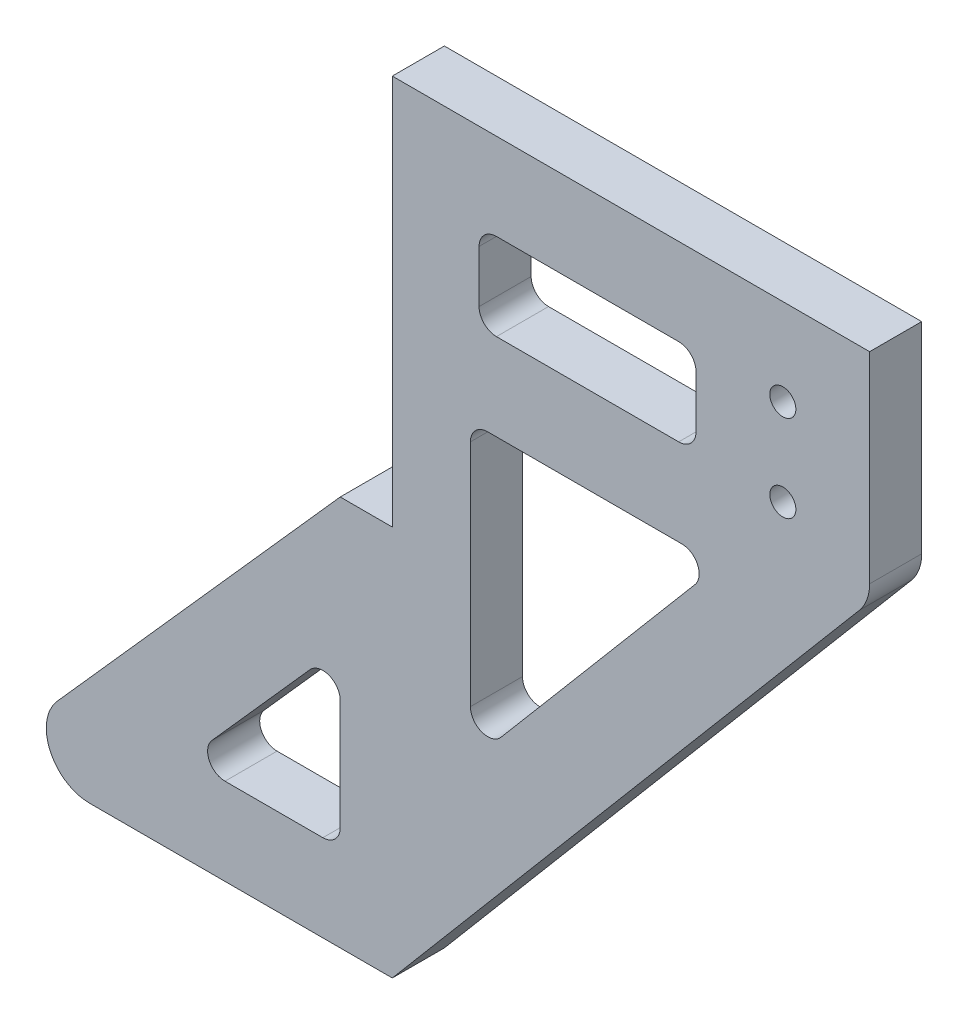
ISO-10303-21;
HEADER;
FILE_DESCRIPTION(('STEP AP214'),'2;1');
FILE_NAME('part.step','',(''),(''),'','','');
FILE_SCHEMA(('AUTOMOTIVE_DESIGN { 1 0 10303 214 1 1 1 1 }'));
ENDSEC;
DATA;
#1=APPLICATION_CONTEXT('core data for automotive mechanical design processes');
#2=APPLICATION_PROTOCOL_DEFINITION('international standard','automotive_design',2000,#1);
#3=PRODUCT_CONTEXT('',#1,'mechanical');
#4=PRODUCT('Part','Part','',(#3));
#5=PRODUCT_RELATED_PRODUCT_CATEGORY('part','',(#4));
#6=PRODUCT_DEFINITION_FORMATION('','',#4);
#7=PRODUCT_DEFINITION_CONTEXT('part definition',#1,'design');
#8=PRODUCT_DEFINITION('design','',#6,#7);
#9=PRODUCT_DEFINITION_SHAPE('','',#8);
#10=(LENGTH_UNIT() NAMED_UNIT(*) SI_UNIT(.MILLI.,.METRE.));
#11=(NAMED_UNIT(*) PLANE_ANGLE_UNIT() SI_UNIT($,.RADIAN.));
#12=(NAMED_UNIT(*) SI_UNIT($,.STERADIAN.) SOLID_ANGLE_UNIT());
#13=UNCERTAINTY_MEASURE_WITH_UNIT(LENGTH_MEASURE(1.E-05),#10,'distance_accuracy_value','');
#14=(GEOMETRIC_REPRESENTATION_CONTEXT(3) GLOBAL_UNCERTAINTY_ASSIGNED_CONTEXT((#13)) GLOBAL_UNIT_ASSIGNED_CONTEXT((#10,
#11,#12)) REPRESENTATION_CONTEXT('',''));
#15=CARTESIAN_POINT('',(0.,0.,0.));
#16=DIRECTION('',(0.,0.,1.));
#17=DIRECTION('',(1.,0.,0.));
#18=AXIS2_PLACEMENT_3D('',#15,#16,#17);
#19=CARTESIAN_POINT('',(0.,0.,6.));
#20=DIRECTION('',(1.,0.,0.));
#21=DIRECTION('',(0.,1.,0.));
#22=AXIS2_PLACEMENT_3D('',#19,#20,#21);
#23=PLANE('',#22);
#24=DIRECTION('',(0.,-1.,0.));
#25=VECTOR('',#24,1.);
#26=CARTESIAN_POINT('',(0.,0.,0.));
#27=LINE('',#26,#25);
#28=CARTESIAN_POINT('',(0.,0.,0.));
#29=VERTEX_POINT('',#28);
#30=CARTESIAN_POINT('',(0.,-45.,0.));
#31=VERTEX_POINT('',#30);
#32=EDGE_CURVE('E255',#29,#31,#27,.T.);
#33=ORIENTED_EDGE('',*,*,#32,.T.);
#34=DIRECTION('',(0.,0.,-1.));
#35=VECTOR('',#34,1.);
#36=CARTESIAN_POINT('',(0.,-45.,6.));
#37=LINE('',#36,#35);
#38=CARTESIAN_POINT('',(0.,-45.,6.));
#39=VERTEX_POINT('',#38);
#40=EDGE_CURVE('E235',#39,#31,#37,.T.);
#41=ORIENTED_EDGE('',*,*,#40,.F.);
#42=DIRECTION('',(0.,-1.,0.));
#43=VECTOR('',#42,1.);
#44=CARTESIAN_POINT('',(0.,0.,6.));
#45=LINE('',#44,#43);
#46=CARTESIAN_POINT('',(0.,0.,6.));
#47=VERTEX_POINT('',#46);
#48=EDGE_CURVE('E241',#47,#39,#45,.T.);
#49=ORIENTED_EDGE('',*,*,#48,.F.);
#50=DIRECTION('',(0.,0.,-1.));
#51=VECTOR('',#50,1.);
#52=CARTESIAN_POINT('',(0.,0.,6.));
#53=LINE('',#52,#51);
#54=EDGE_CURVE('E443',#47,#29,#53,.T.);
#55=ORIENTED_EDGE('',*,*,#54,.T.);
#56=EDGE_LOOP('',(#33,#41,#49,#55));
#57=FACE_BOUND('',#56,.T.);
#58=ADVANCED_FACE('F39',(#57),#23,.F.);
#59=CARTESIAN_POINT('',(0.,-45.,6.));
#60=DIRECTION('',(0.,-1.,0.));
#61=DIRECTION('',(0.,0.,-1.));
#62=AXIS2_PLACEMENT_3D('',#59,#60,#61);
#63=PLANE('',#62);
#64=DIRECTION('',(-1.,0.,0.));
#65=VECTOR('',#64,1.);
#66=CARTESIAN_POINT('',(0.,-45.,0.));
#67=LINE('',#66,#65);
#68=CARTESIAN_POINT('',(-6.,-45.,0.));
#69=VERTEX_POINT('',#68);
#70=EDGE_CURVE('E435',#31,#69,#67,.T.);
#71=ORIENTED_EDGE('',*,*,#70,.T.);
#72=DIRECTION('',(0.,0.,-1.));
#73=VECTOR('',#72,1.);
#74=CARTESIAN_POINT('',(-6.,-45.,6.));
#75=LINE('',#74,#73);
#76=CARTESIAN_POINT('',(-6.,-45.,6.));
#77=VERTEX_POINT('',#76);
#78=EDGE_CURVE('E238',#77,#69,#75,.T.);
#79=ORIENTED_EDGE('',*,*,#78,.F.);
#80=DIRECTION('',(-1.,0.,0.));
#81=VECTOR('',#80,1.);
#82=CARTESIAN_POINT('',(0.,-45.,6.));
#83=LINE('',#82,#81);
#84=EDGE_CURVE('E231',#39,#77,#83,.T.);
#85=ORIENTED_EDGE('',*,*,#84,.F.);
#86=ORIENTED_EDGE('',*,*,#40,.T.);
#87=EDGE_LOOP('',(#71,#79,#85,#86));
#88=FACE_BOUND('',#87,.T.);
#89=ADVANCED_FACE('F233',(#88),#63,.F.);
#90=CARTESIAN_POINT('',(-6.,-45.,6.));
#91=DIRECTION('',(0.74740931868366,-0.66436383882992,0.));
#92=DIRECTION('',(0.66436383882992,0.74740931868366,0.));
#93=AXIS2_PLACEMENT_3D('',#90,#91,#92);
#94=PLANE('',#93);
#95=DIRECTION('',(-0.66436383882992,-0.74740931868366,0.));
#96=VECTOR('',#95,1.);
#97=CARTESIAN_POINT('',(-6.,-45.,0.));
#98=LINE('',#97,#96);
#99=CARTESIAN_POINT('',(-38.6028273829781,-81.6781808058504,0.));
#100=VERTEX_POINT('',#99);
#101=EDGE_CURVE('E429',#69,#100,#98,.T.);
#102=ORIENTED_EDGE('',*,*,#101,.T.);
#103=DIRECTION('',(0.,0.,-1.));
#104=VECTOR('',#103,1.);
#105=CARTESIAN_POINT('',(-38.6028273829781,-81.6781808058504,6.));
#106=LINE('',#105,#104);
#107=CARTESIAN_POINT('',(-38.6028273829781,-81.6781808058504,6.));
#108=VERTEX_POINT('',#107);
#109=EDGE_CURVE('E11',#100,#108,#106,.F.);
#110=ORIENTED_EDGE('',*,*,#109,.T.);
#111=DIRECTION('',(-0.66436383882992,-0.74740931868366,0.));
#112=VECTOR('',#111,1.);
#113=CARTESIAN_POINT('',(-6.,-45.,6.));
#114=LINE('',#113,#112);
#115=EDGE_CURVE('E240',#77,#108,#114,.T.);
#116=ORIENTED_EDGE('',*,*,#115,.F.);
#117=ORIENTED_EDGE('',*,*,#78,.T.);
#118=EDGE_LOOP('',(#102,#110,#116,#117));
#119=FACE_BOUND('',#118,.T.);
#120=ADVANCED_FACE('F470',(#119),#94,.F.);
#121=CARTESIAN_POINT('',(-46.,-90.,6.));
#122=DIRECTION('',(0.,1.,0.));
#123=DIRECTION('',(0.,0.,1.));
#124=AXIS2_PLACEMENT_3D('',#121,#122,#123);
#125=PLANE('',#124);
#126=DIRECTION('',(1.,0.,0.));
#127=VECTOR('',#126,1.);
#128=CARTESIAN_POINT('',(-46.,-90.,6.));
#129=LINE('',#128,#127);
#130=CARTESIAN_POINT('',(-34.8657807895598,-90.,6.));
#131=VERTEX_POINT('',#130);
#132=CARTESIAN_POINT('',(0.,-90.,6.));
#133=VERTEX_POINT('',#132);
#134=EDGE_CURVE('E419',#131,#133,#129,.T.);
#135=ORIENTED_EDGE('',*,*,#134,.F.);
#136=DIRECTION('',(0.,0.,-1.));
#137=VECTOR('',#136,1.);
#138=CARTESIAN_POINT('',(-34.8657807895598,-90.,6.));
#139=LINE('',#138,#137);
#140=CARTESIAN_POINT('',(-34.8657807895598,-90.,0.));
#141=VERTEX_POINT('',#140);
#142=EDGE_CURVE('E48',#131,#141,#139,.T.);
#143=ORIENTED_EDGE('',*,*,#142,.T.);
#144=DIRECTION('',(1.,0.,0.));
#145=VECTOR('',#144,1.);
#146=CARTESIAN_POINT('',(-46.,-90.,0.));
#147=LINE('',#146,#145);
#148=CARTESIAN_POINT('',(0.,-90.,0.));
#149=VERTEX_POINT('',#148);
#150=EDGE_CURVE('E417',#141,#149,#147,.T.);
#151=ORIENTED_EDGE('',*,*,#150,.T.);
#152=DIRECTION('',(0.,0.,-1.));
#153=VECTOR('',#152,1.);
#154=CARTESIAN_POINT('',(0.,-90.,6.));
#155=LINE('',#154,#153);
#156=EDGE_CURVE('E263',#133,#149,#155,.T.);
#157=ORIENTED_EDGE('',*,*,#156,.F.);
#158=EDGE_LOOP('',(#135,#143,#151,#157));
#159=FACE_BOUND('',#158,.T.);
#160=ADVANCED_FACE('F415',(#159),#125,.F.);
#161=CARTESIAN_POINT('',(0.,-90.,6.));
#162=DIRECTION('',(-0.763386285369115,0.645942241466174,0.));
#163=DIRECTION('',(-0.645942241466174,-0.763386285369115,0.));
#164=AXIS2_PLACEMENT_3D('',#161,#162,#163);
#165=PLANE('',#164);
#166=DIRECTION('',(0.645942241466174,0.763386285369115,0.));
#167=VECTOR('',#166,1.);
#168=CARTESIAN_POINT('',(0.,-90.,0.));
#169=LINE('',#168,#167);
#170=CARTESIAN_POINT('',(53.8169314268456,-26.3981719500916,0.));
#171=VERTEX_POINT('',#170);
#172=EDGE_CURVE('E427',#149,#171,#169,.T.);
#173=ORIENTED_EDGE('',*,*,#172,.T.);
#174=DIRECTION('',(0.,0.,-1.));
#175=VECTOR('',#174,1.);
#176=CARTESIAN_POINT('',(53.8169314268456,-26.3981719500916,6.));
#177=LINE('',#176,#175);
#178=CARTESIAN_POINT('',(53.8169314268456,-26.3981719500916,6.));
#179=VERTEX_POINT('',#178);
#180=EDGE_CURVE('E403',#171,#179,#177,.F.);
#181=ORIENTED_EDGE('',*,*,#180,.T.);
#182=DIRECTION('',(0.645942241466174,0.763386285369115,0.));
#183=VECTOR('',#182,1.);
#184=CARTESIAN_POINT('',(0.,-90.,6.));
#185=LINE('',#184,#183);
#186=EDGE_CURVE('E454',#133,#179,#185,.T.);
#187=ORIENTED_EDGE('',*,*,#186,.F.);
#188=ORIENTED_EDGE('',*,*,#156,.T.);
#189=EDGE_LOOP('',(#173,#181,#187,#188));
#190=FACE_BOUND('',#189,.T.);
#191=ADVANCED_FACE('F452',(#190),#165,.F.);
#192=CARTESIAN_POINT('',(55.,0.,6.));
#193=DIRECTION('',(-1.,0.,0.));
#194=DIRECTION('',(0.,-1.,0.));
#195=AXIS2_PLACEMENT_3D('',#192,#193,#194);
#196=PLANE('',#195);
#197=DIRECTION('',(0.,1.,0.));
#198=VECTOR('',#197,1.);
#199=CARTESIAN_POINT('',(55.,0.,6.));
#200=LINE('',#199,#198);
#201=CARTESIAN_POINT('',(55.,-23.1684607427607,6.));
#202=VERTEX_POINT('',#201);
#203=CARTESIAN_POINT('',(55.,0.,6.));
#204=VERTEX_POINT('',#203);
#205=EDGE_CURVE('E457',#202,#204,#200,.T.);
#206=ORIENTED_EDGE('',*,*,#205,.F.);
#207=DIRECTION('',(0.,0.,-1.));
#208=VECTOR('',#207,1.);
#209=CARTESIAN_POINT('',(55.,-23.1684607427607,6.));
#210=LINE('',#209,#208);
#211=CARTESIAN_POINT('',(55.,-23.1684607427607,0.));
#212=VERTEX_POINT('',#211);
#213=EDGE_CURVE('E393',#202,#212,#210,.T.);
#214=ORIENTED_EDGE('',*,*,#213,.T.);
#215=DIRECTION('',(0.,1.,0.));
#216=VECTOR('',#215,1.);
#217=CARTESIAN_POINT('',(55.,0.,0.));
#218=LINE('',#217,#216);
#219=CARTESIAN_POINT('',(55.,0.,0.));
#220=VERTEX_POINT('',#219);
#221=EDGE_CURVE('E433',#212,#220,#218,.T.);
#222=ORIENTED_EDGE('',*,*,#221,.T.);
#223=DIRECTION('',(0.,0.,-1.));
#224=VECTOR('',#223,1.);
#225=CARTESIAN_POINT('',(55.,0.,6.));
#226=LINE('',#225,#224);
#227=EDGE_CURVE('E446',#204,#220,#226,.T.);
#228=ORIENTED_EDGE('',*,*,#227,.F.);
#229=EDGE_LOOP('',(#206,#214,#222,#228));
#230=FACE_BOUND('',#229,.T.);
#231=ADVANCED_FACE('F670',(#230),#196,.F.);
#232=CARTESIAN_POINT('',(0.,0.,6.));
#233=DIRECTION('',(0.,-1.,0.));
#234=DIRECTION('',(0.,0.,-1.));
#235=AXIS2_PLACEMENT_3D('',#232,#233,#234);
#236=PLANE('',#235);
#237=DIRECTION('',(-1.,0.,0.));
#238=VECTOR('',#237,1.);
#239=CARTESIAN_POINT('',(0.,0.,0.));
#240=LINE('',#239,#238);
#241=EDGE_CURVE('E252',#220,#29,#240,.T.);
#242=ORIENTED_EDGE('',*,*,#241,.T.);
#243=ORIENTED_EDGE('',*,*,#54,.F.);
#244=DIRECTION('',(-1.,0.,0.));
#245=VECTOR('',#244,1.);
#246=CARTESIAN_POINT('',(0.,0.,6.));
#247=LINE('',#246,#245);
#248=EDGE_CURVE('E247',#204,#47,#247,.T.);
#249=ORIENTED_EDGE('',*,*,#248,.F.);
#250=ORIENTED_EDGE('',*,*,#227,.T.);
#251=EDGE_LOOP('',(#242,#243,#249,#250));
#252=FACE_BOUND('',#251,.T.);
#253=ADVANCED_FACE('F673',(#252),#236,.F.);
#254=CARTESIAN_POINT('',(0.,0.,6.));
#255=DIRECTION('',(0.,0.,-1.));
#256=DIRECTION('',(-1.,0.,0.));
#257=AXIS2_PLACEMENT_3D('',#254,#255,#256);
#258=PLANE('',#257);
#259=CARTESIAN_POINT('',(45.,-10.,6.));
#260=DIRECTION('',(0.,0.,-1.));
#261=DIRECTION('',(-1.,0.,0.));
#262=AXIS2_PLACEMENT_3D('',#259,#260,#261);
#263=CIRCLE('',#262,1.5);
#264=CARTESIAN_POINT('',(43.5,-10.,6.));
#265=VERTEX_POINT('',#264);
#266=EDGE_CURVE('E468',#265,#265,#263,.T.);
#267=ORIENTED_EDGE('',*,*,#266,.T.);
#268=EDGE_LOOP('',(#267));
#269=FACE_BOUND('',#268,.T.);
#270=CARTESIAN_POINT('',(45.,-20.,6.));
#271=DIRECTION('',(0.,0.,-1.));
#272=DIRECTION('',(-1.,0.,0.));
#273=AXIS2_PLACEMENT_3D('',#270,#271,#272);
#274=CIRCLE('',#273,1.5);
#275=CARTESIAN_POINT('',(43.5,-20.,6.));
#276=VERTEX_POINT('',#275);
#277=EDGE_CURVE('E476',#276,#276,#274,.T.);
#278=ORIENTED_EDGE('',*,*,#277,.T.);
#279=EDGE_LOOP('',(#278));
#280=FACE_BOUND('',#279,.T.);
#281=DIRECTION('',(-1.,0.,0.));
#282=VECTOR('',#281,1.);
#283=CARTESIAN_POINT('',(0.,-80.,6.));
#284=LINE('',#283,#282);
#285=CARTESIAN_POINT('',(-7.99999999999999,-80.,6.));
#286=VERTEX_POINT('',#285);
#287=CARTESIAN_POINT('',(-19.2778738949436,-80.,6.));
#288=VERTEX_POINT('',#287);
#289=EDGE_CURVE('E484',#286,#288,#284,.T.);
#290=ORIENTED_EDGE('',*,*,#289,.T.);
#291=CARTESIAN_POINT('',(-19.2778738949436,-78.,6.));
#292=DIRECTION('',(0.,0.,-1.));
#293=DIRECTION('',(-1.,0.,0.));
#294=AXIS2_PLACEMENT_3D('',#291,#292,#293);
#295=CIRCLE('',#294,2.);
#296=CARTESIAN_POINT('',(-20.7726925323109,-76.6712723223402,6.));
#297=VERTEX_POINT('',#296);
#298=EDGE_CURVE('E336',#288,#297,#295,.T.);
#299=ORIENTED_EDGE('',*,*,#298,.T.);
#300=DIRECTION('',(0.66436383882992,0.74740931868366,0.));
#301=VECTOR('',#300,1.);
#302=CARTESIAN_POINT('',(26.4671966351125,-23.5263970089889,6.));
#303=LINE('',#302,#301);
#304=CARTESIAN_POINT('',(-9.49481863736731,-63.9836641905286,6.));
#305=VERTEX_POINT('',#304);
#306=EDGE_CURVE('E488',#297,#305,#303,.T.);
#307=ORIENTED_EDGE('',*,*,#306,.T.);
#308=CARTESIAN_POINT('',(-8.,-65.3123918681885,6.));
#309=DIRECTION('',(0.,0.,-1.));
#310=DIRECTION('',(-1.,0.,0.));
#311=AXIS2_PLACEMENT_3D('',#308,#309,#310);
#312=CIRCLE('',#311,2.);
#313=CARTESIAN_POINT('',(-6.,-65.3123918681885,6.));
#314=VERTEX_POINT('',#313);
#315=EDGE_CURVE('E348',#305,#314,#312,.T.);
#316=ORIENTED_EDGE('',*,*,#315,.T.);
#317=DIRECTION('',(0.,-1.,0.));
#318=VECTOR('',#317,1.);
#319=CARTESIAN_POINT('',(-6.,0.,6.));
#320=LINE('',#319,#318);
#321=CARTESIAN_POINT('',(-5.99999999999999,-78.,6.));
#322=VERTEX_POINT('',#321);
#323=EDGE_CURVE('E480',#314,#322,#320,.T.);
#324=ORIENTED_EDGE('',*,*,#323,.T.);
#325=CARTESIAN_POINT('',(-7.99999999999999,-78.,6.));
#326=DIRECTION('',(0.,0.,-1.));
#327=DIRECTION('',(-1.,0.,0.));
#328=AXIS2_PLACEMENT_3D('',#325,#326,#327);
#329=CIRCLE('',#328,2.);
#330=EDGE_CURVE('E342',#322,#286,#329,.T.);
#331=ORIENTED_EDGE('',*,*,#330,.T.);
#332=EDGE_LOOP('',(#290,#299,#307,#316,#324,#331));
#333=FACE_BOUND('',#332,.T.);
#334=DIRECTION('',(0.,-1.,0.));
#335=VECTOR('',#334,1.);
#336=CARTESIAN_POINT('',(35.,0.,6.));
#337=LINE('',#336,#335);
#338=CARTESIAN_POINT('',(35.,-12.,6.));
#339=VERTEX_POINT('',#338);
#340=CARTESIAN_POINT('',(35.,-18.,6.));
#341=VERTEX_POINT('',#340);
#342=EDGE_CURVE('E500',#339,#341,#337,.T.);
#343=ORIENTED_EDGE('',*,*,#342,.T.);
#344=CARTESIAN_POINT('',(33.,-18.,6.));
#345=DIRECTION('',(0.,0.,-1.));
#346=DIRECTION('',(-1.,0.,0.));
#347=AXIS2_PLACEMENT_3D('',#344,#345,#346);
#348=CIRCLE('',#347,2.);
#349=CARTESIAN_POINT('',(33.,-20.,6.));
#350=VERTEX_POINT('',#349);
#351=EDGE_CURVE('E318',#341,#350,#348,.T.);
#352=ORIENTED_EDGE('',*,*,#351,.T.);
#353=DIRECTION('',(-1.,0.,0.));
#354=VECTOR('',#353,1.);
#355=CARTESIAN_POINT('',(0.,-20.,6.));
#356=LINE('',#355,#354);
#357=CARTESIAN_POINT('',(12.,-20.,6.));
#358=VERTEX_POINT('',#357);
#359=EDGE_CURVE('E504',#350,#358,#356,.T.);
#360=ORIENTED_EDGE('',*,*,#359,.T.);
#361=CARTESIAN_POINT('',(12.,-18.,6.));
#362=DIRECTION('',(0.,0.,-1.));
#363=DIRECTION('',(-1.,0.,0.));
#364=AXIS2_PLACEMENT_3D('',#361,#362,#363);
#365=CIRCLE('',#364,2.);
#366=CARTESIAN_POINT('',(10.,-18.,6.));
#367=VERTEX_POINT('',#366);
#368=EDGE_CURVE('E312',#358,#367,#365,.T.);
#369=ORIENTED_EDGE('',*,*,#368,.T.);
#370=DIRECTION('',(0.,1.,0.));
#371=VECTOR('',#370,1.);
#372=CARTESIAN_POINT('',(10.,0.,6.));
#373=LINE('',#372,#371);
#374=CARTESIAN_POINT('',(10.,-12.,6.));
#375=VERTEX_POINT('',#374);
#376=EDGE_CURVE('E492',#367,#375,#373,.T.);
#377=ORIENTED_EDGE('',*,*,#376,.T.);
#378=CARTESIAN_POINT('',(12.,-12.,6.));
#379=DIRECTION('',(0.,0.,-1.));
#380=DIRECTION('',(-1.,0.,0.));
#381=AXIS2_PLACEMENT_3D('',#378,#379,#380);
#382=CIRCLE('',#381,2.);
#383=CARTESIAN_POINT('',(12.,-10.,6.));
#384=VERTEX_POINT('',#383);
#385=EDGE_CURVE('E324',#375,#384,#382,.T.);
#386=ORIENTED_EDGE('',*,*,#385,.T.);
#387=DIRECTION('',(1.,0.,0.));
#388=VECTOR('',#387,1.);
#389=CARTESIAN_POINT('',(0.,-10.,6.));
#390=LINE('',#389,#388);
#391=CARTESIAN_POINT('',(33.,-10.,6.));
#392=VERTEX_POINT('',#391);
#393=EDGE_CURVE('E496',#384,#392,#390,.T.);
#394=ORIENTED_EDGE('',*,*,#393,.T.);
#395=CARTESIAN_POINT('',(33.,-12.,6.));
#396=DIRECTION('',(0.,0.,-1.));
#397=DIRECTION('',(-1.,0.,0.));
#398=AXIS2_PLACEMENT_3D('',#395,#396,#397);
#399=CIRCLE('',#398,2.);
#400=EDGE_CURVE('E330',#392,#339,#399,.T.);
#401=ORIENTED_EDGE('',*,*,#400,.T.);
#402=EDGE_LOOP('',(#343,#352,#360,#369,#377,#386,#394,#401));
#403=FACE_BOUND('',#402,.T.);
#404=DIRECTION('',(-0.645942241466174,-0.763386285369115,0.));
#405=VECTOR('',#404,1.);
#406=CARTESIAN_POINT('',(36.7454474911364,-31.0923017232693,6.));
#407=LINE('',#406,#405);
#408=CARTESIAN_POINT('',(34.8842620791138,-33.2918844829323,6.));
#409=VERTEX_POINT('',#408);
#410=CARTESIAN_POINT('',(12.5267725707382,-59.7143720837399,6.));
#411=VERTEX_POINT('',#410);
#412=EDGE_CURVE('E512',#409,#411,#407,.T.);
#413=ORIENTED_EDGE('',*,*,#412,.T.);
#414=CARTESIAN_POINT('',(11.,-58.4224876008075,6.));
#415=DIRECTION('',(0.,0.,-1.));
#416=DIRECTION('',(-1.,0.,0.));
#417=AXIS2_PLACEMENT_3D('',#414,#415,#416);
#418=CIRCLE('',#417,2.);
#419=CARTESIAN_POINT('',(9.00000000000001,-58.4224876008075,6.));
#420=VERTEX_POINT('',#419);
#421=EDGE_CURVE('E375',#411,#420,#418,.T.);
#422=ORIENTED_EDGE('',*,*,#421,.T.);
#423=DIRECTION('',(0.,1.,0.));
#424=VECTOR('',#423,1.);
#425=CARTESIAN_POINT('',(8.99999999999999,0.,6.));
#426=LINE('',#425,#424);
#427=CARTESIAN_POINT('',(9.,-32.,6.));
#428=VERTEX_POINT('',#427);
#429=EDGE_CURVE('E516',#420,#428,#426,.T.);
#430=ORIENTED_EDGE('',*,*,#429,.T.);
#431=CARTESIAN_POINT('',(11.,-32.,6.));
#432=DIRECTION('',(0.,0.,-1.));
#433=DIRECTION('',(-1.,0.,0.));
#434=AXIS2_PLACEMENT_3D('',#431,#432,#433);
#435=CIRCLE('',#434,2.);
#436=CARTESIAN_POINT('',(11.,-30.,6.));
#437=VERTEX_POINT('',#436);
#438=EDGE_CURVE('E381',#428,#437,#435,.T.);
#439=ORIENTED_EDGE('',*,*,#438,.T.);
#440=DIRECTION('',(1.,0.,0.));
#441=VECTOR('',#440,1.);
#442=CARTESIAN_POINT('',(0.,-30.,6.));
#443=LINE('',#442,#441);
#444=CARTESIAN_POINT('',(33.3574895083756,-30.,6.));
#445=VERTEX_POINT('',#444);
#446=EDGE_CURVE('E508',#437,#445,#443,.T.);
#447=ORIENTED_EDGE('',*,*,#446,.T.);
#448=CARTESIAN_POINT('',(33.3574895083756,-32.,6.));
#449=DIRECTION('',(0.,0.,-1.));
#450=DIRECTION('',(-1.,0.,0.));
#451=AXIS2_PLACEMENT_3D('',#448,#449,#450);
#452=CIRCLE('',#451,2.);
#453=EDGE_CURVE('E387',#445,#409,#452,.T.);
#454=ORIENTED_EDGE('',*,*,#453,.T.);
#455=EDGE_LOOP('',(#413,#422,#430,#439,#447,#454));
#456=FACE_BOUND('',#455,.T.);
#457=ORIENTED_EDGE('',*,*,#186,.T.);
#458=CARTESIAN_POINT('',(50.,-23.1684607427607,6.));
#459=DIRECTION('',(0.,0.,-1.));
#460=DIRECTION('',(-1.,0.,0.));
#461=AXIS2_PLACEMENT_3D('',#458,#459,#460);
#462=CIRCLE('',#461,5.);
#463=EDGE_CURVE('E408',#179,#202,#462,.F.);
#464=ORIENTED_EDGE('',*,*,#463,.T.);
#465=ORIENTED_EDGE('',*,*,#205,.T.);
#466=ORIENTED_EDGE('',*,*,#248,.T.);
#467=ORIENTED_EDGE('',*,*,#48,.T.);
#468=ORIENTED_EDGE('',*,*,#84,.T.);
#469=ORIENTED_EDGE('',*,*,#115,.T.);
#470=CARTESIAN_POINT('',(-34.8657807895598,-85.,6.));
#471=DIRECTION('',(0.,0.,-1.));
#472=DIRECTION('',(-1.,0.,0.));
#473=AXIS2_PLACEMENT_3D('',#470,#471,#472);
#474=CIRCLE('',#473,5.);
#475=EDGE_CURVE('E55',#108,#131,#474,.F.);
#476=ORIENTED_EDGE('',*,*,#475,.T.);
#477=ORIENTED_EDGE('',*,*,#134,.T.);
#478=EDGE_LOOP('',(#457,#464,#465,#466,#467,#468,#469,#476,#477));
#479=FACE_BOUND('',#478,.T.);
#480=ADVANCED_FACE('F245',(#269,#280,#333,#403,#456,#479),#258,.F.);
#481=CARTESIAN_POINT('',(0.,0.,0.));
#482=DIRECTION('',(0.,0.,-1.));
#483=DIRECTION('',(-1.,0.,0.));
#484=AXIS2_PLACEMENT_3D('',#481,#482,#483);
#485=PLANE('',#484);
#486=CARTESIAN_POINT('',(45.,-10.,0.));
#487=DIRECTION('',(0.,0.,1.));
#488=DIRECTION('',(1.,0.,0.));
#489=AXIS2_PLACEMENT_3D('',#486,#487,#488);
#490=CIRCLE('',#489,1.5);
#491=CARTESIAN_POINT('',(46.5,-10.,0.));
#492=VERTEX_POINT('',#491);
#493=EDGE_CURVE('E533',#492,#492,#490,.T.);
#494=ORIENTED_EDGE('',*,*,#493,.T.);
#495=EDGE_LOOP('',(#494));
#496=FACE_BOUND('',#495,.T.);
#497=CARTESIAN_POINT('',(45.,-20.,0.));
#498=DIRECTION('',(0.,0.,1.));
#499=DIRECTION('',(1.,0.,0.));
#500=AXIS2_PLACEMENT_3D('',#497,#498,#499);
#501=CIRCLE('',#500,1.5);
#502=CARTESIAN_POINT('',(46.5,-20.,0.));
#503=VERTEX_POINT('',#502);
#504=EDGE_CURVE('E537',#503,#503,#501,.T.);
#505=ORIENTED_EDGE('',*,*,#504,.T.);
#506=EDGE_LOOP('',(#505));
#507=FACE_BOUND('',#506,.T.);
#508=DIRECTION('',(1.,0.,0.));
#509=VECTOR('',#508,1.);
#510=CARTESIAN_POINT('',(-23.7315615791197,-80.,0.));
#511=LINE('',#510,#509);
#512=CARTESIAN_POINT('',(-19.2778738949436,-80.,0.));
#513=VERTEX_POINT('',#512);
#514=CARTESIAN_POINT('',(-7.99999999999999,-80.,0.));
#515=VERTEX_POINT('',#514);
#516=EDGE_CURVE('E542',#513,#515,#511,.T.);
#517=ORIENTED_EDGE('',*,*,#516,.T.);
#518=CARTESIAN_POINT('',(-7.99999999999999,-78.,0.));
#519=DIRECTION('',(0.,0.,-1.));
#520=DIRECTION('',(-1.,0.,0.));
#521=AXIS2_PLACEMENT_3D('',#518,#519,#520);
#522=CIRCLE('',#521,2.);
#523=CARTESIAN_POINT('',(-5.99999999999999,-78.,0.));
#524=VERTEX_POINT('',#523);
#525=EDGE_CURVE('E345',#515,#524,#522,.F.);
#526=ORIENTED_EDGE('',*,*,#525,.T.);
#527=DIRECTION('',(0.,1.,0.));
#528=VECTOR('',#527,1.);
#529=CARTESIAN_POINT('',(-5.99999999999999,-80.,0.));
#530=LINE('',#529,#528);
#531=CARTESIAN_POINT('',(-6.,-65.3123918681885,0.));
#532=VERTEX_POINT('',#531);
#533=EDGE_CURVE('E541',#524,#532,#530,.T.);
#534=ORIENTED_EDGE('',*,*,#533,.T.);
#535=CARTESIAN_POINT('',(-8.,-65.3123918681885,0.));
#536=DIRECTION('',(0.,0.,-1.));
#537=DIRECTION('',(-1.,0.,0.));
#538=AXIS2_PLACEMENT_3D('',#535,#536,#537);
#539=CIRCLE('',#538,2.);
#540=CARTESIAN_POINT('',(-9.49481863736731,-63.9836641905286,0.));
#541=VERTEX_POINT('',#540);
#542=EDGE_CURVE('E351',#532,#541,#539,.F.);
#543=ORIENTED_EDGE('',*,*,#542,.T.);
#544=DIRECTION('',(-0.66436383882992,-0.74740931868366,0.));
#545=VECTOR('',#544,1.);
#546=CARTESIAN_POINT('',(-6.,-60.0519932234904,0.));
#547=LINE('',#546,#545);
#548=CARTESIAN_POINT('',(-20.7726925323109,-76.6712723223402,0.));
#549=VERTEX_POINT('',#548);
#550=EDGE_CURVE('E547',#541,#549,#547,.T.);
#551=ORIENTED_EDGE('',*,*,#550,.T.);
#552=CARTESIAN_POINT('',(-19.2778738949436,-78.,0.));
#553=DIRECTION('',(0.,0.,-1.));
#554=DIRECTION('',(-1.,0.,0.));
#555=AXIS2_PLACEMENT_3D('',#552,#553,#554);
#556=CIRCLE('',#555,2.);
#557=EDGE_CURVE('E339',#549,#513,#556,.F.);
#558=ORIENTED_EDGE('',*,*,#557,.T.);
#559=EDGE_LOOP('',(#517,#526,#534,#543,#551,#558));
#560=FACE_BOUND('',#559,.T.);
#561=DIRECTION('',(-1.,0.,0.));
#562=VECTOR('',#561,1.);
#563=CARTESIAN_POINT('',(10.,-10.,0.));
#564=LINE('',#563,#562);
#565=CARTESIAN_POINT('',(33.,-10.,0.));
#566=VERTEX_POINT('',#565);
#567=CARTESIAN_POINT('',(12.,-10.,0.));
#568=VERTEX_POINT('',#567);
#569=EDGE_CURVE('E532',#566,#568,#564,.T.);
#570=ORIENTED_EDGE('',*,*,#569,.T.);
#571=CARTESIAN_POINT('',(12.,-12.,0.));
#572=DIRECTION('',(0.,0.,-1.));
#573=DIRECTION('',(-1.,0.,0.));
#574=AXIS2_PLACEMENT_3D('',#571,#572,#573);
#575=CIRCLE('',#574,2.);
#576=CARTESIAN_POINT('',(10.,-12.,0.));
#577=VERTEX_POINT('',#576);
#578=EDGE_CURVE('E327',#568,#577,#575,.F.);
#579=ORIENTED_EDGE('',*,*,#578,.T.);
#580=DIRECTION('',(0.,-1.,0.));
#581=VECTOR('',#580,1.);
#582=CARTESIAN_POINT('',(10.,-20.,0.));
#583=LINE('',#582,#581);
#584=CARTESIAN_POINT('',(10.,-18.,0.));
#585=VERTEX_POINT('',#584);
#586=EDGE_CURVE('E546',#577,#585,#583,.T.);
#587=ORIENTED_EDGE('',*,*,#586,.T.);
#588=CARTESIAN_POINT('',(12.,-18.,0.));
#589=DIRECTION('',(0.,0.,-1.));
#590=DIRECTION('',(-1.,0.,0.));
#591=AXIS2_PLACEMENT_3D('',#588,#589,#590);
#592=CIRCLE('',#591,2.);
#593=CARTESIAN_POINT('',(12.,-20.,0.));
#594=VERTEX_POINT('',#593);
#595=EDGE_CURVE('E315',#585,#594,#592,.F.);
#596=ORIENTED_EDGE('',*,*,#595,.T.);
#597=DIRECTION('',(1.,0.,0.));
#598=VECTOR('',#597,1.);
#599=CARTESIAN_POINT('',(10.,-20.,0.));
#600=LINE('',#599,#598);
#601=CARTESIAN_POINT('',(33.,-20.,0.));
#602=VERTEX_POINT('',#601);
#603=EDGE_CURVE('E561',#594,#602,#600,.T.);
#604=ORIENTED_EDGE('',*,*,#603,.T.);
#605=CARTESIAN_POINT('',(33.,-18.,0.));
#606=DIRECTION('',(0.,0.,-1.));
#607=DIRECTION('',(-1.,0.,0.));
#608=AXIS2_PLACEMENT_3D('',#605,#606,#607);
#609=CIRCLE('',#608,2.);
#610=CARTESIAN_POINT('',(35.,-18.,0.));
#611=VERTEX_POINT('',#610);
#612=EDGE_CURVE('E321',#602,#611,#609,.F.);
#613=ORIENTED_EDGE('',*,*,#612,.T.);
#614=DIRECTION('',(0.,1.,0.));
#615=VECTOR('',#614,1.);
#616=CARTESIAN_POINT('',(35.,-20.,0.));
#617=LINE('',#616,#615);
#618=CARTESIAN_POINT('',(35.,-12.,0.));
#619=VERTEX_POINT('',#618);
#620=EDGE_CURVE('E557',#611,#619,#617,.T.);
#621=ORIENTED_EDGE('',*,*,#620,.T.);
#622=CARTESIAN_POINT('',(33.,-12.,0.));
#623=DIRECTION('',(0.,0.,-1.));
#624=DIRECTION('',(-1.,0.,0.));
#625=AXIS2_PLACEMENT_3D('',#622,#623,#624);
#626=CIRCLE('',#625,2.);
#627=EDGE_CURVE('E333',#619,#566,#626,.F.);
#628=ORIENTED_EDGE('',*,*,#627,.T.);
#629=EDGE_LOOP('',(#570,#579,#587,#596,#604,#613,#621,#628));
#630=FACE_BOUND('',#629,.T.);
#631=DIRECTION('',(0.645942241466174,0.763386285369115,0.));
#632=VECTOR('',#631,1.);
#633=CARTESIAN_POINT('',(37.6697027954412,-30.,0.));
#634=LINE('',#633,#632);
#635=CARTESIAN_POINT('',(12.5267725707382,-59.7143720837399,0.));
#636=VERTEX_POINT('',#635);
#637=CARTESIAN_POINT('',(34.8842620791138,-33.2918844829323,0.));
#638=VERTEX_POINT('',#637);
#639=EDGE_CURVE('E520',#636,#638,#634,.T.);
#640=ORIENTED_EDGE('',*,*,#639,.T.);
#641=CARTESIAN_POINT('',(33.3574895083756,-32.,0.));
#642=DIRECTION('',(0.,0.,-1.));
#643=DIRECTION('',(-1.,0.,0.));
#644=AXIS2_PLACEMENT_3D('',#641,#642,#643);
#645=CIRCLE('',#644,2.);
#646=CARTESIAN_POINT('',(33.3574895083756,-30.,0.));
#647=VERTEX_POINT('',#646);
#648=EDGE_CURVE('E390',#638,#647,#645,.F.);
#649=ORIENTED_EDGE('',*,*,#648,.T.);
#650=DIRECTION('',(-1.,0.,0.));
#651=VECTOR('',#650,1.);
#652=CARTESIAN_POINT('',(9.,-30.,0.));
#653=LINE('',#652,#651);
#654=CARTESIAN_POINT('',(11.,-30.,0.));
#655=VERTEX_POINT('',#654);
#656=EDGE_CURVE('E528',#647,#655,#653,.T.);
#657=ORIENTED_EDGE('',*,*,#656,.T.);
#658=CARTESIAN_POINT('',(11.,-32.,0.));
#659=DIRECTION('',(0.,0.,-1.));
#660=DIRECTION('',(-1.,0.,0.));
#661=AXIS2_PLACEMENT_3D('',#658,#659,#660);
#662=CIRCLE('',#661,2.);
#663=CARTESIAN_POINT('',(9.,-32.,0.));
#664=VERTEX_POINT('',#663);
#665=EDGE_CURVE('E384',#655,#664,#662,.F.);
#666=ORIENTED_EDGE('',*,*,#665,.T.);
#667=DIRECTION('',(0.,-1.,0.));
#668=VECTOR('',#667,1.);
#669=CARTESIAN_POINT('',(9.,-30.,0.));
#670=LINE('',#669,#668);
#671=CARTESIAN_POINT('',(9.00000000000001,-58.4224876008075,0.));
#672=VERTEX_POINT('',#671);
#673=EDGE_CURVE('E524',#664,#672,#670,.T.);
#674=ORIENTED_EDGE('',*,*,#673,.T.);
#675=CARTESIAN_POINT('',(11.,-58.4224876008075,0.));
#676=DIRECTION('',(0.,0.,-1.));
#677=DIRECTION('',(-1.,0.,0.));
#678=AXIS2_PLACEMENT_3D('',#675,#676,#677);
#679=CIRCLE('',#678,2.);
#680=EDGE_CURVE('E378',#672,#636,#679,.F.);
#681=ORIENTED_EDGE('',*,*,#680,.T.);
#682=EDGE_LOOP('',(#640,#649,#657,#666,#674,#681));
#683=FACE_BOUND('',#682,.T.);
#684=ORIENTED_EDGE('',*,*,#221,.F.);
#685=CARTESIAN_POINT('',(50.,-23.1684607427607,0.));
#686=DIRECTION('',(0.,0.,-1.));
#687=DIRECTION('',(-1.,0.,0.));
#688=AXIS2_PLACEMENT_3D('',#685,#686,#687);
#689=CIRCLE('',#688,5.);
#690=EDGE_CURVE('E400',#212,#171,#689,.T.);
#691=ORIENTED_EDGE('',*,*,#690,.T.);
#692=ORIENTED_EDGE('',*,*,#172,.F.);
#693=ORIENTED_EDGE('',*,*,#150,.F.);
#694=CARTESIAN_POINT('',(-34.8657807895598,-85.,0.));
#695=DIRECTION('',(0.,0.,-1.));
#696=DIRECTION('',(-1.,0.,0.));
#697=AXIS2_PLACEMENT_3D('',#694,#695,#696);
#698=CIRCLE('',#697,5.);
#699=EDGE_CURVE('E397',#141,#100,#698,.T.);
#700=ORIENTED_EDGE('',*,*,#699,.T.);
#701=ORIENTED_EDGE('',*,*,#101,.F.);
#702=ORIENTED_EDGE('',*,*,#70,.F.);
#703=ORIENTED_EDGE('',*,*,#32,.F.);
#704=ORIENTED_EDGE('',*,*,#241,.F.);
#705=EDGE_LOOP('',(#684,#691,#692,#693,#700,#701,#702,#703,#704));
#706=FACE_BOUND('',#705,.T.);
#707=ADVANCED_FACE('F424',(#496,#507,#560,#630,#683,#706),#485,.T.);
#708=CARTESIAN_POINT('',(9.,-30.,0.));
#709=DIRECTION('',(0.,1.,0.));
#710=DIRECTION('',(-1.,0.,0.));
#711=AXIS2_PLACEMENT_3D('',#708,#709,#710);
#712=PLANE('',#711);
#713=ORIENTED_EDGE('',*,*,#446,.F.);
#714=DIRECTION('',(0.,0.,1.));
#715=VECTOR('',#714,1.);
#716=CARTESIAN_POINT('',(11.,-30.,0.));
#717=LINE('',#716,#715);
#718=EDGE_CURVE('E372',#437,#655,#717,.F.);
#719=ORIENTED_EDGE('',*,*,#718,.T.);
#720=ORIENTED_EDGE('',*,*,#656,.F.);
#721=DIRECTION('',(0.,0.,1.));
#722=VECTOR('',#721,1.);
#723=CARTESIAN_POINT('',(33.3574895083756,-30.,6.));
#724=LINE('',#723,#722);
#725=EDGE_CURVE('E368',#647,#445,#724,.T.);
#726=ORIENTED_EDGE('',*,*,#725,.T.);
#727=EDGE_LOOP('',(#713,#719,#720,#726));
#728=FACE_BOUND('',#727,.T.);
#729=ADVANCED_FACE('F721',(#728),#712,.F.);
#730=CARTESIAN_POINT('',(37.6697027954412,-30.,0.));
#731=DIRECTION('',(0.763386285369115,-0.645942241466174,0.));
#732=DIRECTION('',(0.645942241466174,0.763386285369115,0.));
#733=AXIS2_PLACEMENT_3D('',#730,#731,#732);
#734=PLANE('',#733);
#735=ORIENTED_EDGE('',*,*,#639,.F.);
#736=DIRECTION('',(0.,0.,1.));
#737=VECTOR('',#736,1.);
#738=CARTESIAN_POINT('',(12.5267725707382,-59.7143720837399,6.));
#739=LINE('',#738,#737);
#740=EDGE_CURVE('E357',#636,#411,#739,.T.);
#741=ORIENTED_EDGE('',*,*,#740,.T.);
#742=ORIENTED_EDGE('',*,*,#412,.F.);
#743=DIRECTION('',(0.,0.,1.));
#744=VECTOR('',#743,1.);
#745=CARTESIAN_POINT('',(34.8842620791138,-33.2918844829323,0.));
#746=LINE('',#745,#744);
#747=EDGE_CURVE('E354',#409,#638,#746,.F.);
#748=ORIENTED_EDGE('',*,*,#747,.T.);
#749=EDGE_LOOP('',(#735,#741,#742,#748));
#750=FACE_BOUND('',#749,.T.);
#751=ADVANCED_FACE('F615',(#750),#734,.F.);
#752=CARTESIAN_POINT('',(9.,-30.,0.));
#753=DIRECTION('',(-1.,0.,0.));
#754=DIRECTION('',(0.,-1.,0.));
#755=AXIS2_PLACEMENT_3D('',#752,#753,#754);
#756=PLANE('',#755);
#757=ORIENTED_EDGE('',*,*,#429,.F.);
#758=DIRECTION('',(0.,0.,1.));
#759=VECTOR('',#758,1.);
#760=CARTESIAN_POINT('',(9.00000000000001,-58.4224876008075,0.));
#761=LINE('',#760,#759);
#762=EDGE_CURVE('E365',#420,#672,#761,.F.);
#763=ORIENTED_EDGE('',*,*,#762,.T.);
#764=ORIENTED_EDGE('',*,*,#673,.F.);
#765=DIRECTION('',(0.,0.,1.));
#766=VECTOR('',#765,1.);
#767=CARTESIAN_POINT('',(9.,-32.,6.));
#768=LINE('',#767,#766);
#769=EDGE_CURVE('E361',#664,#428,#768,.T.);
#770=ORIENTED_EDGE('',*,*,#769,.T.);
#771=EDGE_LOOP('',(#757,#763,#764,#770));
#772=FACE_BOUND('',#771,.T.);
#773=ADVANCED_FACE('F608',(#772),#756,.F.);
#774=CARTESIAN_POINT('',(10.,-20.,0.));
#775=DIRECTION('',(-1.,0.,0.));
#776=DIRECTION('',(0.,0.,1.));
#777=AXIS2_PLACEMENT_3D('',#774,#775,#776);
#778=PLANE('',#777);
#779=ORIENTED_EDGE('',*,*,#376,.F.);
#780=DIRECTION('',(0.,0.,1.));
#781=VECTOR('',#780,1.);
#782=CARTESIAN_POINT('',(10.,-18.,0.));
#783=LINE('',#782,#781);
#784=EDGE_CURVE('E274',#367,#585,#783,.F.);
#785=ORIENTED_EDGE('',*,*,#784,.T.);
#786=ORIENTED_EDGE('',*,*,#586,.F.);
#787=DIRECTION('',(0.,0.,1.));
#788=VECTOR('',#787,1.);
#789=CARTESIAN_POINT('',(10.,-12.,6.));
#790=LINE('',#789,#788);
#791=EDGE_CURVE('E270',#577,#375,#790,.T.);
#792=ORIENTED_EDGE('',*,*,#791,.T.);
#793=EDGE_LOOP('',(#779,#785,#786,#792));
#794=FACE_BOUND('',#793,.T.);
#795=ADVANCED_FACE('F606',(#794),#778,.F.);
#796=CARTESIAN_POINT('',(10.,-10.,0.));
#797=DIRECTION('',(0.,1.,0.));
#798=DIRECTION('',(0.,0.,1.));
#799=AXIS2_PLACEMENT_3D('',#796,#797,#798);
#800=PLANE('',#799);
#801=ORIENTED_EDGE('',*,*,#393,.F.);
#802=DIRECTION('',(0.,0.,1.));
#803=VECTOR('',#802,1.);
#804=CARTESIAN_POINT('',(12.,-10.,0.));
#805=LINE('',#804,#803);
#806=EDGE_CURVE('E288',#384,#568,#805,.F.);
#807=ORIENTED_EDGE('',*,*,#806,.T.);
#808=ORIENTED_EDGE('',*,*,#569,.F.);
#809=DIRECTION('',(0.,0.,1.));
#810=VECTOR('',#809,1.);
#811=CARTESIAN_POINT('',(33.,-10.,6.));
#812=LINE('',#811,#810);
#813=EDGE_CURVE('E284',#566,#392,#812,.T.);
#814=ORIENTED_EDGE('',*,*,#813,.T.);
#815=EDGE_LOOP('',(#801,#807,#808,#814));
#816=FACE_BOUND('',#815,.T.);
#817=ADVANCED_FACE('F602',(#816),#800,.F.);
#818=CARTESIAN_POINT('',(35.,-20.,0.));
#819=DIRECTION('',(1.,0.,0.));
#820=DIRECTION('',(0.,0.,-1.));
#821=AXIS2_PLACEMENT_3D('',#818,#819,#820);
#822=PLANE('',#821);
#823=ORIENTED_EDGE('',*,*,#620,.F.);
#824=DIRECTION('',(0.,0.,1.));
#825=VECTOR('',#824,1.);
#826=CARTESIAN_POINT('',(35.,-18.,6.));
#827=LINE('',#826,#825);
#828=EDGE_CURVE('E280',#611,#341,#827,.T.);
#829=ORIENTED_EDGE('',*,*,#828,.T.);
#830=ORIENTED_EDGE('',*,*,#342,.F.);
#831=DIRECTION('',(0.,0.,1.));
#832=VECTOR('',#831,1.);
#833=CARTESIAN_POINT('',(35.,-12.,0.));
#834=LINE('',#833,#832);
#835=EDGE_CURVE('E277',#339,#619,#834,.F.);
#836=ORIENTED_EDGE('',*,*,#835,.T.);
#837=EDGE_LOOP('',(#823,#829,#830,#836));
#838=FACE_BOUND('',#837,.T.);
#839=ADVANCED_FACE('F593',(#838),#822,.F.);
#840=CARTESIAN_POINT('',(10.,-20.,0.));
#841=DIRECTION('',(0.,-1.,0.));
#842=DIRECTION('',(0.,0.,-1.));
#843=AXIS2_PLACEMENT_3D('',#840,#841,#842);
#844=PLANE('',#843);
#845=ORIENTED_EDGE('',*,*,#603,.F.);
#846=DIRECTION('',(0.,0.,1.));
#847=VECTOR('',#846,1.);
#848=CARTESIAN_POINT('',(12.,-20.,6.));
#849=LINE('',#848,#847);
#850=EDGE_CURVE('E261',#594,#358,#849,.T.);
#851=ORIENTED_EDGE('',*,*,#850,.T.);
#852=ORIENTED_EDGE('',*,*,#359,.F.);
#853=DIRECTION('',(0.,0.,1.));
#854=VECTOR('',#853,1.);
#855=CARTESIAN_POINT('',(33.,-20.,0.));
#856=LINE('',#855,#854);
#857=EDGE_CURVE('E257',#350,#602,#856,.F.);
#858=ORIENTED_EDGE('',*,*,#857,.T.);
#859=EDGE_LOOP('',(#845,#851,#852,#858));
#860=FACE_BOUND('',#859,.T.);
#861=ADVANCED_FACE('F581',(#860),#844,.F.);
#862=CARTESIAN_POINT('',(-5.99999999999999,-80.,0.));
#863=DIRECTION('',(1.,0.,0.));
#864=DIRECTION('',(0.,1.,0.));
#865=AXIS2_PLACEMENT_3D('',#862,#863,#864);
#866=PLANE('',#865);
#867=ORIENTED_EDGE('',*,*,#533,.F.);
#868=DIRECTION('',(0.,0.,1.));
#869=VECTOR('',#868,1.);
#870=CARTESIAN_POINT('',(-5.99999999999999,-78.,6.));
#871=LINE('',#870,#869);
#872=EDGE_CURVE('E308',#524,#322,#871,.T.);
#873=ORIENTED_EDGE('',*,*,#872,.T.);
#874=ORIENTED_EDGE('',*,*,#323,.F.);
#875=DIRECTION('',(0.,0.,1.));
#876=VECTOR('',#875,1.);
#877=CARTESIAN_POINT('',(-5.99999999999999,-65.3123918681885,0.));
#878=LINE('',#877,#876);
#879=EDGE_CURVE('E305',#314,#532,#878,.F.);
#880=ORIENTED_EDGE('',*,*,#879,.T.);
#881=EDGE_LOOP('',(#867,#873,#874,#880));
#882=FACE_BOUND('',#881,.T.);
#883=ADVANCED_FACE('F822',(#882),#866,.F.);
#884=CARTESIAN_POINT('',(-23.7315615791197,-80.,0.));
#885=DIRECTION('',(0.,-1.,0.));
#886=DIRECTION('',(0.,0.,-1.));
#887=AXIS2_PLACEMENT_3D('',#884,#885,#886);
#888=PLANE('',#887);
#889=ORIENTED_EDGE('',*,*,#516,.F.);
#890=DIRECTION('',(0.,0.,1.));
#891=VECTOR('',#890,1.);
#892=CARTESIAN_POINT('',(-19.2778738949436,-80.,6.));
#893=LINE('',#892,#891);
#894=EDGE_CURVE('E294',#513,#288,#893,.T.);
#895=ORIENTED_EDGE('',*,*,#894,.T.);
#896=ORIENTED_EDGE('',*,*,#289,.F.);
#897=DIRECTION('',(0.,0.,1.));
#898=VECTOR('',#897,1.);
#899=CARTESIAN_POINT('',(-7.99999999999999,-80.,0.));
#900=LINE('',#899,#898);
#901=EDGE_CURVE('E291',#286,#515,#900,.F.);
#902=ORIENTED_EDGE('',*,*,#901,.T.);
#903=EDGE_LOOP('',(#889,#895,#896,#902));
#904=FACE_BOUND('',#903,.T.);
#905=ADVANCED_FACE('F813',(#904),#888,.F.);
#906=CARTESIAN_POINT('',(-6.,-60.0519932234904,0.));
#907=DIRECTION('',(-0.74740931868366,0.66436383882992,0.));
#908=DIRECTION('',(-0.66436383882992,-0.74740931868366,0.));
#909=AXIS2_PLACEMENT_3D('',#906,#907,#908);
#910=PLANE('',#909);
#911=ORIENTED_EDGE('',*,*,#306,.F.);
#912=DIRECTION('',(0.,0.,1.));
#913=VECTOR('',#912,1.);
#914=CARTESIAN_POINT('',(-20.7726925323109,-76.6712723223402,0.));
#915=LINE('',#914,#913);
#916=EDGE_CURVE('E302',#297,#549,#915,.F.);
#917=ORIENTED_EDGE('',*,*,#916,.T.);
#918=ORIENTED_EDGE('',*,*,#550,.F.);
#919=DIRECTION('',(0.,0.,1.));
#920=VECTOR('',#919,1.);
#921=CARTESIAN_POINT('',(-9.49481863736732,-63.9836641905286,6.));
#922=LINE('',#921,#920);
#923=EDGE_CURVE('E298',#541,#305,#922,.T.);
#924=ORIENTED_EDGE('',*,*,#923,.T.);
#925=EDGE_LOOP('',(#911,#917,#918,#924));
#926=FACE_BOUND('',#925,.T.);
#927=ADVANCED_FACE('F805',(#926),#910,.F.);
#928=CARTESIAN_POINT('',(45.,-20.,0.));
#929=DIRECTION('',(0.,0.,1.));
#930=DIRECTION('',(1.,0.,0.));
#931=AXIS2_PLACEMENT_3D('',#928,#929,#930);
#932=CYLINDRICAL_SURFACE('',#931,1.5);
#933=ORIENTED_EDGE('',*,*,#504,.F.);
#934=EDGE_LOOP('',(#933));
#935=FACE_BOUND('',#934,.T.);
#936=ORIENTED_EDGE('',*,*,#277,.F.);
#937=EDGE_LOOP('',(#936));
#938=FACE_BOUND('',#937,.T.);
#939=ADVANCED_FACE('F796',(#935,#938),#932,.F.);
#940=CARTESIAN_POINT('',(45.,-10.,0.));
#941=DIRECTION('',(0.,0.,1.));
#942=DIRECTION('',(1.,0.,0.));
#943=AXIS2_PLACEMENT_3D('',#940,#941,#942);
#944=CYLINDRICAL_SURFACE('',#943,1.5);
#945=ORIENTED_EDGE('',*,*,#493,.F.);
#946=EDGE_LOOP('',(#945));
#947=FACE_BOUND('',#946,.T.);
#948=ORIENTED_EDGE('',*,*,#266,.F.);
#949=EDGE_LOOP('',(#948));
#950=FACE_BOUND('',#949,.T.);
#951=ADVANCED_FACE('F630',(#947,#950),#944,.F.);
#952=CARTESIAN_POINT('',(12.,-18.,0.));
#953=DIRECTION('',(0.,0.,-1.));
#954=DIRECTION('',(-1.,0.,0.));
#955=AXIS2_PLACEMENT_3D('',#952,#953,#954);
#956=CYLINDRICAL_SURFACE('',#955,2.);
#957=ORIENTED_EDGE('',*,*,#595,.F.);
#958=ORIENTED_EDGE('',*,*,#784,.F.);
#959=ORIENTED_EDGE('',*,*,#368,.F.);
#960=ORIENTED_EDGE('',*,*,#850,.F.);
#961=EDGE_LOOP('',(#957,#958,#959,#960));
#962=FACE_BOUND('',#961,.T.);
#963=ADVANCED_FACE('F578',(#962),#956,.F.);
#964=CARTESIAN_POINT('',(33.,-18.,0.));
#965=DIRECTION('',(0.,0.,-1.));
#966=DIRECTION('',(-1.,0.,0.));
#967=AXIS2_PLACEMENT_3D('',#964,#965,#966);
#968=CYLINDRICAL_SURFACE('',#967,2.);
#969=ORIENTED_EDGE('',*,*,#612,.F.);
#970=ORIENTED_EDGE('',*,*,#857,.F.);
#971=ORIENTED_EDGE('',*,*,#351,.F.);
#972=ORIENTED_EDGE('',*,*,#828,.F.);
#973=EDGE_LOOP('',(#969,#970,#971,#972));
#974=FACE_BOUND('',#973,.T.);
#975=ADVANCED_FACE('F590',(#974),#968,.F.);
#976=CARTESIAN_POINT('',(12.,-12.,0.));
#977=DIRECTION('',(0.,0.,-1.));
#978=DIRECTION('',(-1.,0.,0.));
#979=AXIS2_PLACEMENT_3D('',#976,#977,#978);
#980=CYLINDRICAL_SURFACE('',#979,2.);
#981=ORIENTED_EDGE('',*,*,#578,.F.);
#982=ORIENTED_EDGE('',*,*,#806,.F.);
#983=ORIENTED_EDGE('',*,*,#385,.F.);
#984=ORIENTED_EDGE('',*,*,#791,.F.);
#985=EDGE_LOOP('',(#981,#982,#983,#984));
#986=FACE_BOUND('',#985,.T.);
#987=ADVANCED_FACE('F605',(#986),#980,.F.);
#988=CARTESIAN_POINT('',(33.,-12.,0.));
#989=DIRECTION('',(0.,0.,-1.));
#990=DIRECTION('',(-1.,0.,0.));
#991=AXIS2_PLACEMENT_3D('',#988,#989,#990);
#992=CYLINDRICAL_SURFACE('',#991,2.);
#993=ORIENTED_EDGE('',*,*,#627,.F.);
#994=ORIENTED_EDGE('',*,*,#835,.F.);
#995=ORIENTED_EDGE('',*,*,#400,.F.);
#996=ORIENTED_EDGE('',*,*,#813,.F.);
#997=EDGE_LOOP('',(#993,#994,#995,#996));
#998=FACE_BOUND('',#997,.T.);
#999=ADVANCED_FACE('F599',(#998),#992,.F.);
#1000=CARTESIAN_POINT('',(-19.2778738949436,-78.,0.));
#1001=DIRECTION('',(0.,0.,-1.));
#1002=DIRECTION('',(-1.,0.,0.));
#1003=AXIS2_PLACEMENT_3D('',#1000,#1001,#1002);
#1004=CYLINDRICAL_SURFACE('',#1003,2.);
#1005=ORIENTED_EDGE('',*,*,#557,.F.);
#1006=ORIENTED_EDGE('',*,*,#916,.F.);
#1007=ORIENTED_EDGE('',*,*,#298,.F.);
#1008=ORIENTED_EDGE('',*,*,#894,.F.);
#1009=EDGE_LOOP('',(#1005,#1006,#1007,#1008));
#1010=FACE_BOUND('',#1009,.T.);
#1011=ADVANCED_FACE('F637',(#1010),#1004,.F.);
#1012=CARTESIAN_POINT('',(-7.99999999999999,-78.,0.));
#1013=DIRECTION('',(0.,0.,-1.));
#1014=DIRECTION('',(-1.,0.,0.));
#1015=AXIS2_PLACEMENT_3D('',#1012,#1013,#1014);
#1016=CYLINDRICAL_SURFACE('',#1015,2.);
#1017=ORIENTED_EDGE('',*,*,#525,.F.);
#1018=ORIENTED_EDGE('',*,*,#901,.F.);
#1019=ORIENTED_EDGE('',*,*,#330,.F.);
#1020=ORIENTED_EDGE('',*,*,#872,.F.);
#1021=EDGE_LOOP('',(#1017,#1018,#1019,#1020));
#1022=FACE_BOUND('',#1021,.T.);
#1023=ADVANCED_FACE('F640',(#1022),#1016,.F.);
#1024=CARTESIAN_POINT('',(-8.,-65.3123918681885,0.));
#1025=DIRECTION('',(0.,0.,-1.));
#1026=DIRECTION('',(-1.,0.,0.));
#1027=AXIS2_PLACEMENT_3D('',#1024,#1025,#1026);
#1028=CYLINDRICAL_SURFACE('',#1027,2.);
#1029=ORIENTED_EDGE('',*,*,#542,.F.);
#1030=ORIENTED_EDGE('',*,*,#879,.F.);
#1031=ORIENTED_EDGE('',*,*,#315,.F.);
#1032=ORIENTED_EDGE('',*,*,#923,.F.);
#1033=EDGE_LOOP('',(#1029,#1030,#1031,#1032));
#1034=FACE_BOUND('',#1033,.T.);
#1035=ADVANCED_FACE('F644',(#1034),#1028,.F.);
#1036=CARTESIAN_POINT('',(11.,-58.4224876008075,0.));
#1037=DIRECTION('',(0.,0.,-1.));
#1038=DIRECTION('',(-1.,0.,0.));
#1039=AXIS2_PLACEMENT_3D('',#1036,#1037,#1038);
#1040=CYLINDRICAL_SURFACE('',#1039,2.);
#1041=ORIENTED_EDGE('',*,*,#680,.F.);
#1042=ORIENTED_EDGE('',*,*,#762,.F.);
#1043=ORIENTED_EDGE('',*,*,#421,.F.);
#1044=ORIENTED_EDGE('',*,*,#740,.F.);
#1045=EDGE_LOOP('',(#1041,#1042,#1043,#1044));
#1046=FACE_BOUND('',#1045,.T.);
#1047=ADVANCED_FACE('F648',(#1046),#1040,.F.);
#1048=CARTESIAN_POINT('',(11.,-32.,0.));
#1049=DIRECTION('',(0.,0.,-1.));
#1050=DIRECTION('',(-1.,0.,0.));
#1051=AXIS2_PLACEMENT_3D('',#1048,#1049,#1050);
#1052=CYLINDRICAL_SURFACE('',#1051,2.);
#1053=ORIENTED_EDGE('',*,*,#665,.F.);
#1054=ORIENTED_EDGE('',*,*,#718,.F.);
#1055=ORIENTED_EDGE('',*,*,#438,.F.);
#1056=ORIENTED_EDGE('',*,*,#769,.F.);
#1057=EDGE_LOOP('',(#1053,#1054,#1055,#1056));
#1058=FACE_BOUND('',#1057,.T.);
#1059=ADVANCED_FACE('F652',(#1058),#1052,.F.);
#1060=CARTESIAN_POINT('',(33.3574895083756,-32.,0.));
#1061=DIRECTION('',(0.,0.,-1.));
#1062=DIRECTION('',(-1.,0.,0.));
#1063=AXIS2_PLACEMENT_3D('',#1060,#1061,#1062);
#1064=CYLINDRICAL_SURFACE('',#1063,2.);
#1065=ORIENTED_EDGE('',*,*,#648,.F.);
#1066=ORIENTED_EDGE('',*,*,#747,.F.);
#1067=ORIENTED_EDGE('',*,*,#453,.F.);
#1068=ORIENTED_EDGE('',*,*,#725,.F.);
#1069=EDGE_LOOP('',(#1065,#1066,#1067,#1068));
#1070=FACE_BOUND('',#1069,.T.);
#1071=ADVANCED_FACE('F656',(#1070),#1064,.F.);
#1072=CARTESIAN_POINT('',(50.,-23.1684607427607,6.));
#1073=DIRECTION('',(0.,0.,-1.));
#1074=DIRECTION('',(-1.,0.,0.));
#1075=AXIS2_PLACEMENT_3D('',#1072,#1073,#1074);
#1076=CYLINDRICAL_SURFACE('',#1075,5.);
#1077=ORIENTED_EDGE('',*,*,#463,.F.);
#1078=ORIENTED_EDGE('',*,*,#180,.F.);
#1079=ORIENTED_EDGE('',*,*,#690,.F.);
#1080=ORIENTED_EDGE('',*,*,#213,.F.);
#1081=EDGE_LOOP('',(#1077,#1078,#1079,#1080));
#1082=FACE_BOUND('',#1081,.T.);
#1083=ADVANCED_FACE('F659',(#1082),#1076,.T.);
#1084=CARTESIAN_POINT('',(-34.8657807895598,-85.,6.));
#1085=DIRECTION('',(0.,0.,-1.));
#1086=DIRECTION('',(-1.,0.,0.));
#1087=AXIS2_PLACEMENT_3D('',#1084,#1085,#1086);
#1088=CYLINDRICAL_SURFACE('',#1087,5.);
#1089=ORIENTED_EDGE('',*,*,#475,.F.);
#1090=ORIENTED_EDGE('',*,*,#109,.F.);
#1091=ORIENTED_EDGE('',*,*,#699,.F.);
#1092=ORIENTED_EDGE('',*,*,#142,.F.);
#1093=EDGE_LOOP('',(#1089,#1090,#1091,#1092));
#1094=FACE_BOUND('',#1093,.T.);
#1095=ADVANCED_FACE('F41',(#1094),#1088,.T.);
#1096=CLOSED_SHELL('',(#58,#89,#120,#160,#191,#231,#253,#480,#707,#729,#751,#773,#795,#817,#839,
#861,#883,#905,#927,#939,#951,#963,#975,#987,#999,#1011,#1023,#1035,#1047,#1059,#1071,#1083,#1095));
#1097=MANIFOLD_SOLID_BREP('B2',#1096);
#1098=ADVANCED_BREP_SHAPE_REPRESENTATION('',(#18,#1097),#14);
#1099=SHAPE_DEFINITION_REPRESENTATION(#9,#1098);
ENDSEC;
END-ISO-10303-21;
